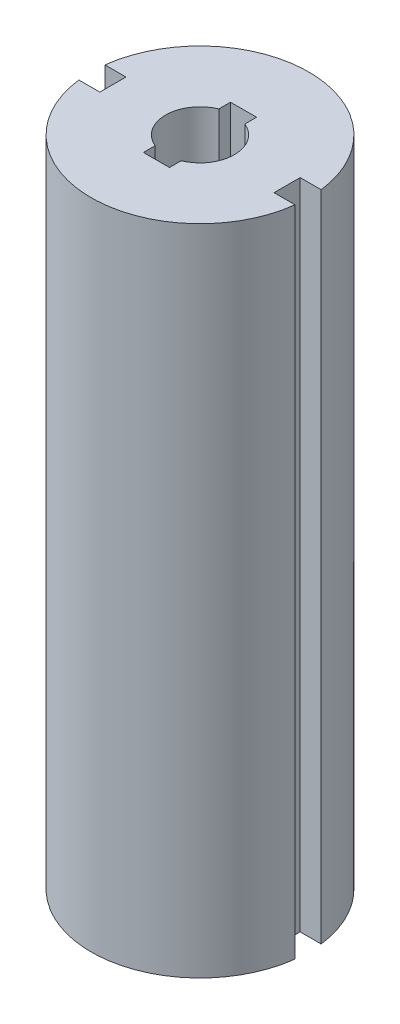
ISO-10303-21;
HEADER;
FILE_DESCRIPTION(('STEP AP214'),'2;1');
FILE_NAME('part.step','',(''),(''),'','','');
FILE_SCHEMA(('AUTOMOTIVE_DESIGN { 1 0 10303 214 1 1 1 1 }'));
ENDSEC;
DATA;
#1=APPLICATION_CONTEXT('core data for automotive mechanical design processes');
#2=APPLICATION_PROTOCOL_DEFINITION('international standard','automotive_design',2000,#1);
#3=PRODUCT_CONTEXT('',#1,'mechanical');
#4=PRODUCT('Part','Part','',(#3));
#5=PRODUCT_RELATED_PRODUCT_CATEGORY('part','',(#4));
#6=PRODUCT_DEFINITION_FORMATION('','',#4);
#7=PRODUCT_DEFINITION_CONTEXT('part definition',#1,'design');
#8=PRODUCT_DEFINITION('design','',#6,#7);
#9=PRODUCT_DEFINITION_SHAPE('','',#8);
#10=(LENGTH_UNIT() NAMED_UNIT(*) SI_UNIT(.MILLI.,.METRE.));
#11=(NAMED_UNIT(*) PLANE_ANGLE_UNIT() SI_UNIT($,.RADIAN.));
#12=(NAMED_UNIT(*) SI_UNIT($,.STERADIAN.) SOLID_ANGLE_UNIT());
#13=UNCERTAINTY_MEASURE_WITH_UNIT(LENGTH_MEASURE(1.E-05),#10,'distance_accuracy_value','');
#14=(GEOMETRIC_REPRESENTATION_CONTEXT(3) GLOBAL_UNCERTAINTY_ASSIGNED_CONTEXT((#13)) GLOBAL_UNIT_ASSIGNED_CONTEXT((#10,
#11,#12)) REPRESENTATION_CONTEXT('',''));
#15=CARTESIAN_POINT('',(0.,0.,0.));
#16=DIRECTION('',(0.,0.,1.));
#17=DIRECTION('',(1.,0.,0.));
#18=AXIS2_PLACEMENT_3D('',#15,#16,#17);
#19=CARTESIAN_POINT('',(0.,19.05,0.));
#20=DIRECTION('',(0.,1.,0.));
#21=DIRECTION('',(0.,0.,1.));
#22=AXIS2_PLACEMENT_3D('',#19,#20,#21);
#23=PLANE('',#22);
#24=DIRECTION('',(0.,0.,-1.));
#25=VECTOR('',#24,1.);
#26=CARTESIAN_POINT('',(2.54,19.05,0.381000000000001));
#27=LINE('',#26,#25);
#28=CARTESIAN_POINT('',(2.54,19.05,0.381000000000001));
#29=VERTEX_POINT('',#28);
#30=CARTESIAN_POINT('',(2.54,19.05,-0.380999999999998));
#31=VERTEX_POINT('',#30);
#32=EDGE_CURVE('E160',#29,#31,#27,.T.);
#33=ORIENTED_EDGE('',*,*,#32,.T.);
#34=DIRECTION('',(1.,0.,0.));
#35=VECTOR('',#34,1.);
#36=CARTESIAN_POINT('',(2.54,19.05,-0.380999999999998));
#37=LINE('',#36,#35);
#38=CARTESIAN_POINT('',(3.15205710608168,19.05,-0.380999999999999));
#39=VERTEX_POINT('',#38);
#40=EDGE_CURVE('E100',#31,#39,#37,.T.);
#41=ORIENTED_EDGE('',*,*,#40,.T.);
#42=CARTESIAN_POINT('',(0.,19.05,0.));
#43=DIRECTION('',(0.,1.,0.));
#44=DIRECTION('',(0.,0.,1.));
#45=AXIS2_PLACEMENT_3D('',#42,#43,#44);
#46=CIRCLE('',#45,3.175);
#47=CARTESIAN_POINT('',(-3.15205710608168,19.05,-0.380999999999999));
#48=VERTEX_POINT('',#47);
#49=EDGE_CURVE('E175',#39,#48,#46,.T.);
#50=ORIENTED_EDGE('',*,*,#49,.T.);
#51=DIRECTION('',(1.,0.,0.));
#52=VECTOR('',#51,1.);
#53=CARTESIAN_POINT('',(-2.54,19.05,-0.380999999999999));
#54=LINE('',#53,#52);
#55=CARTESIAN_POINT('',(-2.54,19.05,-0.380999999999999));
#56=VERTEX_POINT('',#55);
#57=EDGE_CURVE('E187',#48,#56,#54,.T.);
#58=ORIENTED_EDGE('',*,*,#57,.T.);
#59=DIRECTION('',(0.,0.,1.));
#60=VECTOR('',#59,1.);
#61=CARTESIAN_POINT('',(-2.54,19.05,0.381000000000001));
#62=LINE('',#61,#60);
#63=CARTESIAN_POINT('',(-2.54,19.05,0.381000000000001));
#64=VERTEX_POINT('',#63);
#65=EDGE_CURVE('E123',#56,#64,#62,.T.);
#66=ORIENTED_EDGE('',*,*,#65,.T.);
#67=DIRECTION('',(-1.,0.,0.));
#68=VECTOR('',#67,1.);
#69=CARTESIAN_POINT('',(-2.54,19.05,0.381000000000001));
#70=LINE('',#69,#68);
#71=CARTESIAN_POINT('',(-3.15205710608168,19.05,0.380999999999999));
#72=VERTEX_POINT('',#71);
#73=EDGE_CURVE('E116',#64,#72,#70,.T.);
#74=ORIENTED_EDGE('',*,*,#73,.T.);
#75=CARTESIAN_POINT('',(0.,19.05,0.));
#76=DIRECTION('',(0.,1.,0.));
#77=DIRECTION('',(0.,0.,1.));
#78=AXIS2_PLACEMENT_3D('',#75,#76,#77);
#79=CIRCLE('',#78,3.175);
#80=CARTESIAN_POINT('',(3.15205710608168,19.05,0.381000000000001));
#81=VERTEX_POINT('',#80);
#82=EDGE_CURVE('E120',#72,#81,#79,.T.);
#83=ORIENTED_EDGE('',*,*,#82,.T.);
#84=DIRECTION('',(-1.,0.,0.));
#85=VECTOR('',#84,1.);
#86=CARTESIAN_POINT('',(2.54,19.05,0.381000000000001));
#87=LINE('',#86,#85);
#88=EDGE_CURVE('E59',#81,#29,#87,.T.);
#89=ORIENTED_EDGE('',*,*,#88,.T.);
#90=EDGE_LOOP('',(#33,#41,#50,#58,#66,#74,#83,#89));
#91=FACE_BOUND('',#90,.T.);
#92=CARTESIAN_POINT('',(0.,19.05,0.));
#93=DIRECTION('',(0.,1.,0.));
#94=DIRECTION('',(0.,0.,1.));
#95=AXIS2_PLACEMENT_3D('',#92,#93,#94);
#96=CIRCLE('',#95,1.0033);
#97=CARTESIAN_POINT('',(-0.380189942934095,19.05,-0.928475361704214));
#98=VERTEX_POINT('',#97);
#99=CARTESIAN_POINT('',(-0.380189942934095,19.05,0.928475361704214));
#100=VERTEX_POINT('',#99);
#101=EDGE_CURVE('E215',#98,#100,#96,.T.);
#102=ORIENTED_EDGE('',*,*,#101,.F.);
#103=DIRECTION('',(0.,0.,-1.));
#104=VECTOR('',#103,1.);
#105=CARTESIAN_POINT('',(-0.380189942934095,19.05,-0.928475361704214));
#106=LINE('',#105,#104);
#107=CARTESIAN_POINT('',(-0.380189942934095,19.05,-1.27));
#108=VERTEX_POINT('',#107);
#109=EDGE_CURVE('E50',#98,#108,#106,.T.);
#110=ORIENTED_EDGE('',*,*,#109,.T.);
#111=DIRECTION('',(1.,0.,0.));
#112=VECTOR('',#111,1.);
#113=CARTESIAN_POINT('',(-0.380189942934095,19.05,-1.27));
#114=LINE('',#113,#112);
#115=CARTESIAN_POINT('',(0.380189942934095,19.05,-1.27));
#116=VERTEX_POINT('',#115);
#117=EDGE_CURVE('E234',#108,#116,#114,.T.);
#118=ORIENTED_EDGE('',*,*,#117,.T.);
#119=DIRECTION('',(0.,0.,-1.));
#120=VECTOR('',#119,1.);
#121=CARTESIAN_POINT('',(0.380189942934095,19.05,-0.928475361704214));
#122=LINE('',#121,#120);
#123=CARTESIAN_POINT('',(0.380189942934095,19.05,-0.928475361704214));
#124=VERTEX_POINT('',#123);
#125=EDGE_CURVE('E231',#124,#116,#122,.T.);
#126=ORIENTED_EDGE('',*,*,#125,.F.);
#127=CARTESIAN_POINT('',(0.,19.05,0.));
#128=DIRECTION('',(0.,1.,0.));
#129=DIRECTION('',(0.,0.,1.));
#130=AXIS2_PLACEMENT_3D('',#127,#128,#129);
#131=CIRCLE('',#130,1.0033);
#132=CARTESIAN_POINT('',(0.380189942934095,19.05,0.928475361704214));
#133=VERTEX_POINT('',#132);
#134=EDGE_CURVE('E228',#133,#124,#131,.T.);
#135=ORIENTED_EDGE('',*,*,#134,.F.);
#136=DIRECTION('',(0.,0.,-1.));
#137=VECTOR('',#136,1.);
#138=CARTESIAN_POINT('',(0.380189942934095,19.05,1.27));
#139=LINE('',#138,#137);
#140=CARTESIAN_POINT('',(0.380189942934095,19.05,1.27));
#141=VERTEX_POINT('',#140);
#142=EDGE_CURVE('E225',#141,#133,#139,.T.);
#143=ORIENTED_EDGE('',*,*,#142,.F.);
#144=DIRECTION('',(1.,0.,0.));
#145=VECTOR('',#144,1.);
#146=CARTESIAN_POINT('',(-0.380189942934095,19.05,1.27));
#147=LINE('',#146,#145);
#148=CARTESIAN_POINT('',(-0.380189942934095,19.05,1.27));
#149=VERTEX_POINT('',#148);
#150=EDGE_CURVE('E222',#149,#141,#147,.T.);
#151=ORIENTED_EDGE('',*,*,#150,.F.);
#152=DIRECTION('',(0.,0.,-1.));
#153=VECTOR('',#152,1.);
#154=CARTESIAN_POINT('',(-0.380189942934095,19.05,1.27));
#155=LINE('',#154,#153);
#156=EDGE_CURVE('E219',#149,#100,#155,.T.);
#157=ORIENTED_EDGE('',*,*,#156,.T.);
#158=EDGE_LOOP('',(#102,#110,#118,#126,#135,#143,#151,#157));
#159=FACE_BOUND('',#158,.T.);
#160=ADVANCED_FACE('F35',(#91,#159),#23,.T.);
#161=CARTESIAN_POINT('',(2.54,19.05,0.381000000000001));
#162=DIRECTION('',(-1.,0.,0.));
#163=DIRECTION('',(0.,0.,1.));
#164=AXIS2_PLACEMENT_3D('',#161,#162,#163);
#165=PLANE('',#164);
#166=DIRECTION('',(0.,0.,-1.));
#167=VECTOR('',#166,1.);
#168=CARTESIAN_POINT('',(2.54,0.,0.381000000000001));
#169=LINE('',#168,#167);
#170=CARTESIAN_POINT('',(2.54,0.,0.381000000000001));
#171=VERTEX_POINT('',#170);
#172=CARTESIAN_POINT('',(2.54,0.,-0.380999999999998));
#173=VERTEX_POINT('',#172);
#174=EDGE_CURVE('E144',#171,#173,#169,.T.);
#175=ORIENTED_EDGE('',*,*,#174,.T.);
#176=DIRECTION('',(0.,-1.,0.));
#177=VECTOR('',#176,1.);
#178=CARTESIAN_POINT('',(2.54,19.05,-0.380999999999998));
#179=LINE('',#178,#177);
#180=EDGE_CURVE('E11',#31,#173,#179,.T.);
#181=ORIENTED_EDGE('',*,*,#180,.F.);
#182=ORIENTED_EDGE('',*,*,#32,.F.);
#183=DIRECTION('',(0.,-1.,0.));
#184=VECTOR('',#183,1.);
#185=CARTESIAN_POINT('',(2.54,19.05,0.381000000000001));
#186=LINE('',#185,#184);
#187=EDGE_CURVE('E140',#29,#171,#186,.T.);
#188=ORIENTED_EDGE('',*,*,#187,.T.);
#189=EDGE_LOOP('',(#175,#181,#182,#188));
#190=FACE_BOUND('',#189,.T.);
#191=ADVANCED_FACE('F37',(#190),#165,.F.);
#192=CARTESIAN_POINT('',(2.54,19.05,-0.380999999999998));
#193=DIRECTION('',(0.,0.,-1.));
#194=DIRECTION('',(-1.,0.,0.));
#195=AXIS2_PLACEMENT_3D('',#192,#193,#194);
#196=PLANE('',#195);
#197=DIRECTION('',(1.,0.,0.));
#198=VECTOR('',#197,1.);
#199=CARTESIAN_POINT('',(2.54,0.,-0.380999999999998));
#200=LINE('',#199,#198);
#201=CARTESIAN_POINT('',(3.15205710608168,0.,-0.380999999999999));
#202=VERTEX_POINT('',#201);
#203=EDGE_CURVE('E147',#173,#202,#200,.T.);
#204=ORIENTED_EDGE('',*,*,#203,.T.);
#205=DIRECTION('',(0.,-1.,0.));
#206=VECTOR('',#205,1.);
#207=CARTESIAN_POINT('',(3.15205710608168,19.05,-0.380999999999999));
#208=LINE('',#207,#206);
#209=EDGE_CURVE('E43',#39,#202,#208,.T.);
#210=ORIENTED_EDGE('',*,*,#209,.F.);
#211=ORIENTED_EDGE('',*,*,#40,.F.);
#212=ORIENTED_EDGE('',*,*,#180,.T.);
#213=EDGE_LOOP('',(#204,#210,#211,#212));
#214=FACE_BOUND('',#213,.T.);
#215=ADVANCED_FACE('F337',(#214),#196,.F.);
#216=CARTESIAN_POINT('',(0.,19.05,0.));
#217=DIRECTION('',(0.,-1.,0.));
#218=DIRECTION('',(0.,0.,-1.));
#219=AXIS2_PLACEMENT_3D('',#216,#217,#218);
#220=CYLINDRICAL_SURFACE('',#219,3.175);
#221=CARTESIAN_POINT('',(0.,0.,0.));
#222=DIRECTION('',(0.,1.,0.));
#223=DIRECTION('',(0.,0.,1.));
#224=AXIS2_PLACEMENT_3D('',#221,#222,#223);
#225=CIRCLE('',#224,3.175);
#226=CARTESIAN_POINT('',(-3.15205710608168,0.,-0.380999999999999));
#227=VERTEX_POINT('',#226);
#228=EDGE_CURVE('E150',#202,#227,#225,.T.);
#229=ORIENTED_EDGE('',*,*,#228,.T.);
#230=DIRECTION('',(0.,-1.,0.));
#231=VECTOR('',#230,1.);
#232=CARTESIAN_POINT('',(-3.15205710608168,19.05,-0.380999999999999));
#233=LINE('',#232,#231);
#234=EDGE_CURVE('E167',#48,#227,#233,.T.);
#235=ORIENTED_EDGE('',*,*,#234,.F.);
#236=ORIENTED_EDGE('',*,*,#49,.F.);
#237=ORIENTED_EDGE('',*,*,#209,.T.);
#238=EDGE_LOOP('',(#229,#235,#236,#237));
#239=FACE_BOUND('',#238,.T.);
#240=ADVANCED_FACE('F173',(#239),#220,.T.);
#241=CARTESIAN_POINT('',(-2.54,19.05,-0.380999999999999));
#242=DIRECTION('',(0.,0.,-1.));
#243=DIRECTION('',(-1.,0.,0.));
#244=AXIS2_PLACEMENT_3D('',#241,#242,#243);
#245=PLANE('',#244);
#246=DIRECTION('',(1.,0.,0.));
#247=VECTOR('',#246,1.);
#248=CARTESIAN_POINT('',(-2.54,0.,-0.380999999999999));
#249=LINE('',#248,#247);
#250=CARTESIAN_POINT('',(-2.54,0.,-0.380999999999999));
#251=VERTEX_POINT('',#250);
#252=EDGE_CURVE('E152',#227,#251,#249,.T.);
#253=ORIENTED_EDGE('',*,*,#252,.T.);
#254=DIRECTION('',(0.,-1.,0.));
#255=VECTOR('',#254,1.);
#256=CARTESIAN_POINT('',(-2.54,19.05,-0.380999999999999));
#257=LINE('',#256,#255);
#258=EDGE_CURVE('E164',#56,#251,#257,.T.);
#259=ORIENTED_EDGE('',*,*,#258,.F.);
#260=ORIENTED_EDGE('',*,*,#57,.F.);
#261=ORIENTED_EDGE('',*,*,#234,.T.);
#262=EDGE_LOOP('',(#253,#259,#260,#261));
#263=FACE_BOUND('',#262,.T.);
#264=ADVANCED_FACE('F183',(#263),#245,.F.);
#265=CARTESIAN_POINT('',(-2.54,19.05,0.381000000000001));
#266=DIRECTION('',(1.,0.,0.));
#267=DIRECTION('',(0.,0.,-1.));
#268=AXIS2_PLACEMENT_3D('',#265,#266,#267);
#269=PLANE('',#268);
#270=DIRECTION('',(0.,0.,1.));
#271=VECTOR('',#270,1.);
#272=CARTESIAN_POINT('',(-2.54,0.,0.381000000000001));
#273=LINE('',#272,#271);
#274=CARTESIAN_POINT('',(-2.54,0.,0.381000000000001));
#275=VERTEX_POINT('',#274);
#276=EDGE_CURVE('E154',#251,#275,#273,.T.);
#277=ORIENTED_EDGE('',*,*,#276,.T.);
#278=DIRECTION('',(0.,-1.,0.));
#279=VECTOR('',#278,1.);
#280=CARTESIAN_POINT('',(-2.54,19.05,0.381000000000001));
#281=LINE('',#280,#279);
#282=EDGE_CURVE('E135',#64,#275,#281,.T.);
#283=ORIENTED_EDGE('',*,*,#282,.F.);
#284=ORIENTED_EDGE('',*,*,#65,.F.);
#285=ORIENTED_EDGE('',*,*,#258,.T.);
#286=EDGE_LOOP('',(#277,#283,#284,#285));
#287=FACE_BOUND('',#286,.T.);
#288=ADVANCED_FACE('F186',(#287),#269,.F.);
#289=CARTESIAN_POINT('',(-2.54,19.05,0.381000000000001));
#290=DIRECTION('',(0.,0.,1.));
#291=DIRECTION('',(1.,0.,0.));
#292=AXIS2_PLACEMENT_3D('',#289,#290,#291);
#293=PLANE('',#292);
#294=DIRECTION('',(-1.,0.,0.));
#295=VECTOR('',#294,1.);
#296=CARTESIAN_POINT('',(-2.54,0.,0.381000000000001));
#297=LINE('',#296,#295);
#298=CARTESIAN_POINT('',(-3.15205710608168,0.,0.380999999999999));
#299=VERTEX_POINT('',#298);
#300=EDGE_CURVE('E132',#275,#299,#297,.T.);
#301=ORIENTED_EDGE('',*,*,#300,.T.);
#302=DIRECTION('',(0.,-1.,0.));
#303=VECTOR('',#302,1.);
#304=CARTESIAN_POINT('',(-3.15205710608168,19.05,0.380999999999999));
#305=LINE('',#304,#303);
#306=EDGE_CURVE('E129',#72,#299,#305,.T.);
#307=ORIENTED_EDGE('',*,*,#306,.F.);
#308=ORIENTED_EDGE('',*,*,#73,.F.);
#309=ORIENTED_EDGE('',*,*,#282,.T.);
#310=EDGE_LOOP('',(#301,#307,#308,#309));
#311=FACE_BOUND('',#310,.T.);
#312=ADVANCED_FACE('F130',(#311),#293,.F.);
#313=CARTESIAN_POINT('',(0.,19.05,0.));
#314=DIRECTION('',(0.,-1.,0.));
#315=DIRECTION('',(0.,0.,-1.));
#316=AXIS2_PLACEMENT_3D('',#313,#314,#315);
#317=CYLINDRICAL_SURFACE('',#316,3.175);
#318=CARTESIAN_POINT('',(0.,0.,0.));
#319=DIRECTION('',(0.,1.,0.));
#320=DIRECTION('',(0.,0.,1.));
#321=AXIS2_PLACEMENT_3D('',#318,#319,#320);
#322=CIRCLE('',#321,3.175);
#323=CARTESIAN_POINT('',(3.15205710608168,0.,0.381000000000001));
#324=VERTEX_POINT('',#323);
#325=EDGE_CURVE('E157',#299,#324,#322,.T.);
#326=ORIENTED_EDGE('',*,*,#325,.T.);
#327=DIRECTION('',(0.,-1.,0.));
#328=VECTOR('',#327,1.);
#329=CARTESIAN_POINT('',(3.15205710608168,19.05,0.381000000000001));
#330=LINE('',#329,#328);
#331=EDGE_CURVE('E136',#81,#324,#330,.T.);
#332=ORIENTED_EDGE('',*,*,#331,.F.);
#333=ORIENTED_EDGE('',*,*,#82,.F.);
#334=ORIENTED_EDGE('',*,*,#306,.T.);
#335=EDGE_LOOP('',(#326,#332,#333,#334));
#336=FACE_BOUND('',#335,.T.);
#337=ADVANCED_FACE('F138',(#336),#317,.T.);
#338=CARTESIAN_POINT('',(2.54,19.05,0.381000000000001));
#339=DIRECTION('',(0.,0.,1.));
#340=DIRECTION('',(1.,0.,0.));
#341=AXIS2_PLACEMENT_3D('',#338,#339,#340);
#342=PLANE('',#341);
#343=DIRECTION('',(-1.,0.,0.));
#344=VECTOR('',#343,1.);
#345=CARTESIAN_POINT('',(2.54,0.,0.381000000000001));
#346=LINE('',#345,#344);
#347=EDGE_CURVE('E92',#324,#171,#346,.T.);
#348=ORIENTED_EDGE('',*,*,#347,.T.);
#349=ORIENTED_EDGE('',*,*,#187,.F.);
#350=ORIENTED_EDGE('',*,*,#88,.F.);
#351=ORIENTED_EDGE('',*,*,#331,.T.);
#352=EDGE_LOOP('',(#348,#349,#350,#351));
#353=FACE_BOUND('',#352,.T.);
#354=ADVANCED_FACE('F343',(#353),#342,.F.);
#355=CARTESIAN_POINT('',(0.,0.,0.));
#356=DIRECTION('',(0.,1.,0.));
#357=DIRECTION('',(0.,0.,1.));
#358=AXIS2_PLACEMENT_3D('',#355,#356,#357);
#359=PLANE('',#358);
#360=ORIENTED_EDGE('',*,*,#174,.F.);
#361=ORIENTED_EDGE('',*,*,#347,.F.);
#362=ORIENTED_EDGE('',*,*,#325,.F.);
#363=ORIENTED_EDGE('',*,*,#300,.F.);
#364=ORIENTED_EDGE('',*,*,#276,.F.);
#365=ORIENTED_EDGE('',*,*,#252,.F.);
#366=ORIENTED_EDGE('',*,*,#228,.F.);
#367=ORIENTED_EDGE('',*,*,#203,.F.);
#368=EDGE_LOOP('',(#360,#361,#362,#363,#364,#365,#366,#367));
#369=FACE_BOUND('',#368,.T.);
#370=ADVANCED_FACE('F179',(#369),#359,.F.);
#371=CARTESIAN_POINT('',(-0.380189942934095,11.43,-0.928475361704214));
#372=DIRECTION('',(1.,0.,0.));
#373=DIRECTION('',(0.,0.,-1.));
#374=AXIS2_PLACEMENT_3D('',#371,#372,#373);
#375=PLANE('',#374);
#376=ORIENTED_EDGE('',*,*,#109,.F.);
#377=DIRECTION('',(0.,1.,0.));
#378=VECTOR('',#377,1.);
#379=CARTESIAN_POINT('',(-0.380189942934095,11.43,-0.928475361704214));
#380=LINE('',#379,#378);
#381=CARTESIAN_POINT('',(-0.380189942934095,11.43,-0.928475361704214));
#382=VERTEX_POINT('',#381);
#383=EDGE_CURVE('E212',#382,#98,#380,.T.);
#384=ORIENTED_EDGE('',*,*,#383,.F.);
#385=DIRECTION('',(0.,0.,-1.));
#386=VECTOR('',#385,1.);
#387=CARTESIAN_POINT('',(-0.380189942934095,11.43,-0.928475361704214));
#388=LINE('',#387,#386);
#389=CARTESIAN_POINT('',(-0.380189942934095,11.43,-1.27));
#390=VERTEX_POINT('',#389);
#391=EDGE_CURVE('E218',#382,#390,#388,.T.);
#392=ORIENTED_EDGE('',*,*,#391,.T.);
#393=DIRECTION('',(0.,1.,0.));
#394=VECTOR('',#393,1.);
#395=CARTESIAN_POINT('',(-0.380189942934095,11.43,-1.27));
#396=LINE('',#395,#394);
#397=EDGE_CURVE('E148',#390,#108,#396,.T.);
#398=ORIENTED_EDGE('',*,*,#397,.T.);
#399=EDGE_LOOP('',(#376,#384,#392,#398));
#400=FACE_BOUND('',#399,.T.);
#401=ADVANCED_FACE('F262',(#400),#375,.T.);
#402=CARTESIAN_POINT('',(-0.380189942934095,11.43,-1.27));
#403=DIRECTION('',(0.,0.,1.));
#404=DIRECTION('',(1.,0.,0.));
#405=AXIS2_PLACEMENT_3D('',#402,#403,#404);
#406=PLANE('',#405);
#407=ORIENTED_EDGE('',*,*,#117,.F.);
#408=ORIENTED_EDGE('',*,*,#397,.F.);
#409=DIRECTION('',(1.,0.,0.));
#410=VECTOR('',#409,1.);
#411=CARTESIAN_POINT('',(-0.380189942934095,11.43,-1.27));
#412=LINE('',#411,#410);
#413=CARTESIAN_POINT('',(0.380189942934095,11.43,-1.27));
#414=VERTEX_POINT('',#413);
#415=EDGE_CURVE('E255',#390,#414,#412,.T.);
#416=ORIENTED_EDGE('',*,*,#415,.T.);
#417=DIRECTION('',(0.,1.,0.));
#418=VECTOR('',#417,1.);
#419=CARTESIAN_POINT('',(0.380189942934095,11.43,-1.27));
#420=LINE('',#419,#418);
#421=EDGE_CURVE('E194',#414,#116,#420,.T.);
#422=ORIENTED_EDGE('',*,*,#421,.T.);
#423=EDGE_LOOP('',(#407,#408,#416,#422));
#424=FACE_BOUND('',#423,.T.);
#425=ADVANCED_FACE('F271',(#424),#406,.T.);
#426=CARTESIAN_POINT('',(0.380189942934095,11.43,-0.928475361704214));
#427=DIRECTION('',(1.,0.,0.));
#428=DIRECTION('',(0.,0.,-1.));
#429=AXIS2_PLACEMENT_3D('',#426,#427,#428);
#430=PLANE('',#429);
#431=ORIENTED_EDGE('',*,*,#125,.T.);
#432=ORIENTED_EDGE('',*,*,#421,.F.);
#433=DIRECTION('',(0.,0.,-1.));
#434=VECTOR('',#433,1.);
#435=CARTESIAN_POINT('',(0.380189942934095,11.43,-0.928475361704214));
#436=LINE('',#435,#434);
#437=CARTESIAN_POINT('',(0.380189942934095,11.43,-0.928475361704214));
#438=VERTEX_POINT('',#437);
#439=EDGE_CURVE('E252',#438,#414,#436,.T.);
#440=ORIENTED_EDGE('',*,*,#439,.F.);
#441=DIRECTION('',(0.,1.,0.));
#442=VECTOR('',#441,1.);
#443=CARTESIAN_POINT('',(0.380189942934095,11.43,-0.928475361704214));
#444=LINE('',#443,#442);
#445=EDGE_CURVE('E197',#438,#124,#444,.T.);
#446=ORIENTED_EDGE('',*,*,#445,.T.);
#447=EDGE_LOOP('',(#431,#432,#440,#446));
#448=FACE_BOUND('',#447,.T.);
#449=ADVANCED_FACE('F323',(#448),#430,.F.);
#450=CARTESIAN_POINT('',(0.,11.43,0.));
#451=DIRECTION('',(0.,1.,0.));
#452=DIRECTION('',(0.,0.,1.));
#453=AXIS2_PLACEMENT_3D('',#450,#451,#452);
#454=CYLINDRICAL_SURFACE('',#453,1.0033);
#455=ORIENTED_EDGE('',*,*,#134,.T.);
#456=ORIENTED_EDGE('',*,*,#445,.F.);
#457=CARTESIAN_POINT('',(0.,11.43,0.));
#458=DIRECTION('',(0.,1.,0.));
#459=DIRECTION('',(0.,0.,1.));
#460=AXIS2_PLACEMENT_3D('',#457,#458,#459);
#461=CIRCLE('',#460,1.0033);
#462=CARTESIAN_POINT('',(0.380189942934095,11.43,0.928475361704214));
#463=VERTEX_POINT('',#462);
#464=EDGE_CURVE('E249',#463,#438,#461,.T.);
#465=ORIENTED_EDGE('',*,*,#464,.F.);
#466=DIRECTION('',(0.,1.,0.));
#467=VECTOR('',#466,1.);
#468=CARTESIAN_POINT('',(0.380189942934095,11.43,0.928475361704214));
#469=LINE('',#468,#467);
#470=EDGE_CURVE('E200',#463,#133,#469,.T.);
#471=ORIENTED_EDGE('',*,*,#470,.T.);
#472=EDGE_LOOP('',(#455,#456,#465,#471));
#473=FACE_BOUND('',#472,.T.);
#474=ADVANCED_FACE('F321',(#473),#454,.F.);
#475=CARTESIAN_POINT('',(0.380189942934095,11.43,1.27));
#476=DIRECTION('',(1.,0.,0.));
#477=DIRECTION('',(0.,0.,-1.));
#478=AXIS2_PLACEMENT_3D('',#475,#476,#477);
#479=PLANE('',#478);
#480=ORIENTED_EDGE('',*,*,#142,.T.);
#481=ORIENTED_EDGE('',*,*,#470,.F.);
#482=DIRECTION('',(0.,0.,-1.));
#483=VECTOR('',#482,1.);
#484=CARTESIAN_POINT('',(0.380189942934095,11.43,1.27));
#485=LINE('',#484,#483);
#486=CARTESIAN_POINT('',(0.380189942934095,11.43,1.27));
#487=VERTEX_POINT('',#486);
#488=EDGE_CURVE('E246',#487,#463,#485,.T.);
#489=ORIENTED_EDGE('',*,*,#488,.F.);
#490=DIRECTION('',(0.,1.,0.));
#491=VECTOR('',#490,1.);
#492=CARTESIAN_POINT('',(0.380189942934095,11.43,1.27));
#493=LINE('',#492,#491);
#494=EDGE_CURVE('E203',#487,#141,#493,.T.);
#495=ORIENTED_EDGE('',*,*,#494,.T.);
#496=EDGE_LOOP('',(#480,#481,#489,#495));
#497=FACE_BOUND('',#496,.T.);
#498=ADVANCED_FACE('F309',(#497),#479,.F.);
#499=CARTESIAN_POINT('',(-0.380189942934095,11.43,1.27));
#500=DIRECTION('',(0.,0.,1.));
#501=DIRECTION('',(1.,0.,0.));
#502=AXIS2_PLACEMENT_3D('',#499,#500,#501);
#503=PLANE('',#502);
#504=ORIENTED_EDGE('',*,*,#150,.T.);
#505=ORIENTED_EDGE('',*,*,#494,.F.);
#506=DIRECTION('',(1.,0.,0.));
#507=VECTOR('',#506,1.);
#508=CARTESIAN_POINT('',(-0.380189942934095,11.43,1.27));
#509=LINE('',#508,#507);
#510=CARTESIAN_POINT('',(-0.380189942934095,11.43,1.27));
#511=VERTEX_POINT('',#510);
#512=EDGE_CURVE('E243',#511,#487,#509,.T.);
#513=ORIENTED_EDGE('',*,*,#512,.F.);
#514=DIRECTION('',(0.,1.,0.));
#515=VECTOR('',#514,1.);
#516=CARTESIAN_POINT('',(-0.380189942934095,11.43,1.27));
#517=LINE('',#516,#515);
#518=EDGE_CURVE('E206',#511,#149,#517,.T.);
#519=ORIENTED_EDGE('',*,*,#518,.T.);
#520=EDGE_LOOP('',(#504,#505,#513,#519));
#521=FACE_BOUND('',#520,.T.);
#522=ADVANCED_FACE('F301',(#521),#503,.F.);
#523=CARTESIAN_POINT('',(-0.380189942934095,11.43,1.27));
#524=DIRECTION('',(1.,0.,0.));
#525=DIRECTION('',(0.,0.,-1.));
#526=AXIS2_PLACEMENT_3D('',#523,#524,#525);
#527=PLANE('',#526);
#528=ORIENTED_EDGE('',*,*,#156,.F.);
#529=ORIENTED_EDGE('',*,*,#518,.F.);
#530=DIRECTION('',(0.,0.,-1.));
#531=VECTOR('',#530,1.);
#532=CARTESIAN_POINT('',(-0.380189942934095,11.43,1.27));
#533=LINE('',#532,#531);
#534=CARTESIAN_POINT('',(-0.380189942934095,11.43,0.928475361704214));
#535=VERTEX_POINT('',#534);
#536=EDGE_CURVE('E240',#511,#535,#533,.T.);
#537=ORIENTED_EDGE('',*,*,#536,.T.);
#538=DIRECTION('',(0.,1.,0.));
#539=VECTOR('',#538,1.);
#540=CARTESIAN_POINT('',(-0.380189942934095,11.43,0.928475361704214));
#541=LINE('',#540,#539);
#542=EDGE_CURVE('E209',#535,#100,#541,.T.);
#543=ORIENTED_EDGE('',*,*,#542,.T.);
#544=EDGE_LOOP('',(#528,#529,#537,#543));
#545=FACE_BOUND('',#544,.T.);
#546=ADVANCED_FACE('F293',(#545),#527,.T.);
#547=CARTESIAN_POINT('',(0.,11.43,0.));
#548=DIRECTION('',(0.,1.,0.));
#549=DIRECTION('',(0.,0.,1.));
#550=AXIS2_PLACEMENT_3D('',#547,#548,#549);
#551=CYLINDRICAL_SURFACE('',#550,1.0033);
#552=ORIENTED_EDGE('',*,*,#101,.T.);
#553=ORIENTED_EDGE('',*,*,#542,.F.);
#554=CARTESIAN_POINT('',(0.,11.43,0.));
#555=DIRECTION('',(0.,1.,0.));
#556=DIRECTION('',(0.,0.,1.));
#557=AXIS2_PLACEMENT_3D('',#554,#555,#556);
#558=CIRCLE('',#557,1.0033);
#559=EDGE_CURVE('E214',#382,#535,#558,.T.);
#560=ORIENTED_EDGE('',*,*,#559,.F.);
#561=ORIENTED_EDGE('',*,*,#383,.T.);
#562=EDGE_LOOP('',(#552,#553,#560,#561));
#563=FACE_BOUND('',#562,.T.);
#564=ADVANCED_FACE('F298',(#563),#551,.F.);
#565=CARTESIAN_POINT('',(0.,11.43,0.));
#566=DIRECTION('',(0.,1.,0.));
#567=DIRECTION('',(0.,0.,1.));
#568=AXIS2_PLACEMENT_3D('',#565,#566,#567);
#569=PLANE('',#568);
#570=ORIENTED_EDGE('',*,*,#391,.F.);
#571=ORIENTED_EDGE('',*,*,#559,.T.);
#572=ORIENTED_EDGE('',*,*,#536,.F.);
#573=ORIENTED_EDGE('',*,*,#512,.T.);
#574=ORIENTED_EDGE('',*,*,#488,.T.);
#575=ORIENTED_EDGE('',*,*,#464,.T.);
#576=ORIENTED_EDGE('',*,*,#439,.T.);
#577=ORIENTED_EDGE('',*,*,#415,.F.);
#578=EDGE_LOOP('',(#570,#571,#572,#573,#574,#575,#576,#577));
#579=FACE_BOUND('',#578,.T.);
#580=ADVANCED_FACE('F311',(#579),#569,.T.);
#581=CLOSED_SHELL('',(#160,#191,#215,#240,#264,#288,#312,#337,#354,#370,#401,#425,#449,#474,
#498,#522,#546,#564,#580));
#582=MANIFOLD_SOLID_BREP('B2',#581);
#583=ADVANCED_BREP_SHAPE_REPRESENTATION('',(#18,#582),#14);
#584=SHAPE_DEFINITION_REPRESENTATION(#9,#583);
ENDSEC;
END-ISO-10303-21;
